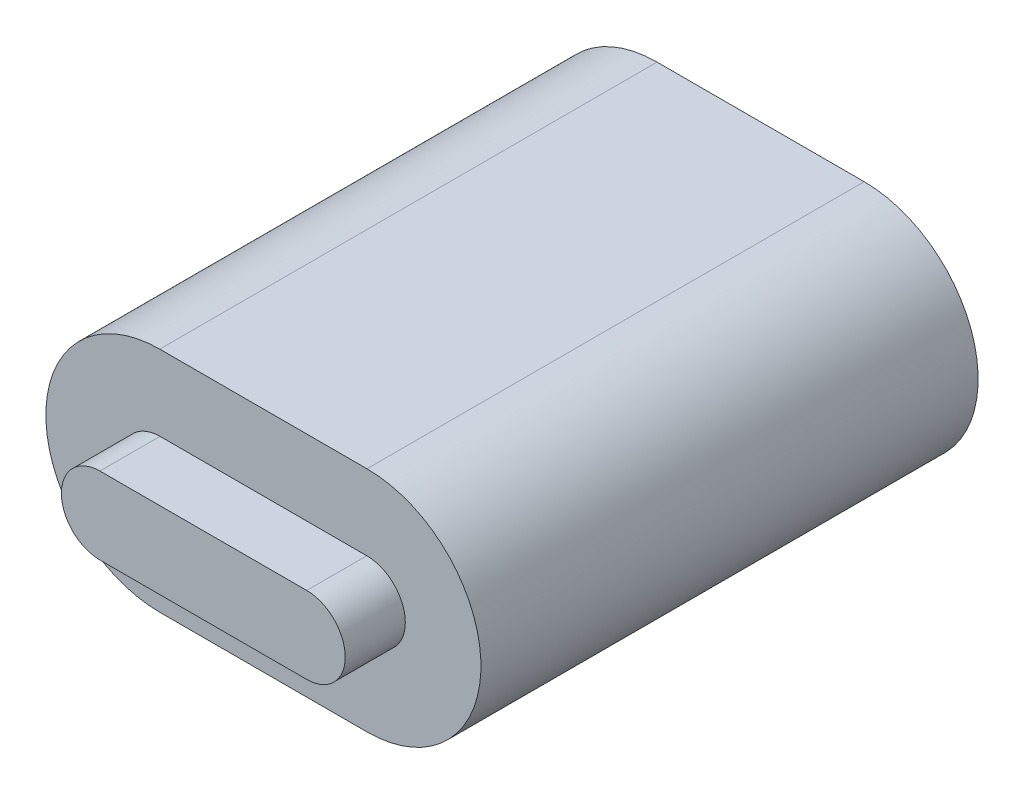
ISO-10303-21;
HEADER;
FILE_DESCRIPTION(('STEP AP214'),'2;1');
FILE_NAME('part.step','',(''),(''),'','','');
FILE_SCHEMA(('AUTOMOTIVE_DESIGN { 1 0 10303 214 1 1 1 1 }'));
ENDSEC;
DATA;
#1=APPLICATION_CONTEXT('core data for automotive mechanical design processes');
#2=APPLICATION_PROTOCOL_DEFINITION('international standard','automotive_design',2000,#1);
#3=PRODUCT_CONTEXT('',#1,'mechanical');
#4=PRODUCT('Part','Part','',(#3));
#5=PRODUCT_RELATED_PRODUCT_CATEGORY('part','',(#4));
#6=PRODUCT_DEFINITION_FORMATION('','',#4);
#7=PRODUCT_DEFINITION_CONTEXT('part definition',#1,'design');
#8=PRODUCT_DEFINITION('design','',#6,#7);
#9=PRODUCT_DEFINITION_SHAPE('','',#8);
#10=(LENGTH_UNIT() NAMED_UNIT(*) SI_UNIT(.MILLI.,.METRE.));
#11=(NAMED_UNIT(*) PLANE_ANGLE_UNIT() SI_UNIT($,.RADIAN.));
#12=(NAMED_UNIT(*) SI_UNIT($,.STERADIAN.) SOLID_ANGLE_UNIT());
#13=UNCERTAINTY_MEASURE_WITH_UNIT(LENGTH_MEASURE(1.E-05),#10,'distance_accuracy_value','');
#14=(GEOMETRIC_REPRESENTATION_CONTEXT(3) GLOBAL_UNCERTAINTY_ASSIGNED_CONTEXT((#13)) GLOBAL_UNIT_ASSIGNED_CONTEXT((#10,
#11,#12)) REPRESENTATION_CONTEXT('',''));
#15=CARTESIAN_POINT('',(0.,0.,0.));
#16=DIRECTION('',(0.,0.,1.));
#17=DIRECTION('',(1.,0.,0.));
#18=AXIS2_PLACEMENT_3D('',#15,#16,#17);
#19=CARTESIAN_POINT('',(-2.495,0.,1.45));
#20=DIRECTION('',(0.,0.,-1.));
#21=DIRECTION('',(-1.,0.,0.));
#22=AXIS2_PLACEMENT_3D('',#19,#20,#21);
#23=CYLINDRICAL_SURFACE('',#22,0.930000000000002);
#24=CARTESIAN_POINT('',(-2.495,0.,0.));
#25=DIRECTION('',(0.,0.,1.));
#26=DIRECTION('',(1.,0.,0.));
#27=AXIS2_PLACEMENT_3D('',#24,#25,#26);
#28=CIRCLE('',#27,0.930000000000002);
#29=CARTESIAN_POINT('',(-2.495,0.930000000000002,0.));
#30=VERTEX_POINT('',#29);
#31=CARTESIAN_POINT('',(-2.495,-0.930000000000002,0.));
#32=VERTEX_POINT('',#31);
#33=EDGE_CURVE('E118',#30,#32,#28,.T.);
#34=ORIENTED_EDGE('',*,*,#33,.T.);
#35=DIRECTION('',(0.,0.,-1.));
#36=VECTOR('',#35,1.);
#37=CARTESIAN_POINT('',(-2.495,-0.930000000000002,1.45));
#38=LINE('',#37,#36);
#39=CARTESIAN_POINT('',(-2.495,-0.930000000000002,1.45));
#40=VERTEX_POINT('',#39);
#41=EDGE_CURVE('E11',#40,#32,#38,.T.);
#42=ORIENTED_EDGE('',*,*,#41,.F.);
#43=CARTESIAN_POINT('',(-2.495,0.,1.45));
#44=DIRECTION('',(0.,0.,1.));
#45=DIRECTION('',(1.,0.,0.));
#46=AXIS2_PLACEMENT_3D('',#43,#44,#45);
#47=CIRCLE('',#46,0.930000000000002);
#48=CARTESIAN_POINT('',(-2.495,0.930000000000002,1.45));
#49=VERTEX_POINT('',#48);
#50=EDGE_CURVE('E127',#49,#40,#47,.T.);
#51=ORIENTED_EDGE('',*,*,#50,.F.);
#52=DIRECTION('',(0.,0.,-1.));
#53=VECTOR('',#52,1.);
#54=CARTESIAN_POINT('',(-2.495,0.930000000000002,1.45));
#55=LINE('',#54,#53);
#56=EDGE_CURVE('E134',#49,#30,#55,.T.);
#57=ORIENTED_EDGE('',*,*,#56,.T.);
#58=EDGE_LOOP('',(#34,#42,#51,#57));
#59=FACE_BOUND('',#58,.T.);
#60=ADVANCED_FACE('F33',(#59),#23,.T.);
#61=CARTESIAN_POINT('',(-2.495,-0.930000000000002,1.45));
#62=DIRECTION('',(0.,1.,0.));
#63=DIRECTION('',(0.,0.,1.));
#64=AXIS2_PLACEMENT_3D('',#61,#62,#63);
#65=PLANE('',#64);
#66=DIRECTION('',(1.,0.,0.));
#67=VECTOR('',#66,1.);
#68=CARTESIAN_POINT('',(-2.495,-0.930000000000002,0.));
#69=LINE('',#68,#67);
#70=CARTESIAN_POINT('',(2.495,-0.930000000000003,0.));
#71=VERTEX_POINT('',#70);
#72=EDGE_CURVE('E121',#32,#71,#69,.T.);
#73=ORIENTED_EDGE('',*,*,#72,.T.);
#74=DIRECTION('',(0.,0.,-1.));
#75=VECTOR('',#74,1.);
#76=CARTESIAN_POINT('',(2.495,-0.930000000000003,1.45));
#77=LINE('',#76,#75);
#78=CARTESIAN_POINT('',(2.495,-0.930000000000003,1.45));
#79=VERTEX_POINT('',#78);
#80=EDGE_CURVE('E41',#79,#71,#77,.T.);
#81=ORIENTED_EDGE('',*,*,#80,.F.);
#82=DIRECTION('',(1.,0.,0.));
#83=VECTOR('',#82,1.);
#84=CARTESIAN_POINT('',(-2.495,-0.930000000000002,1.45));
#85=LINE('',#84,#83);
#86=EDGE_CURVE('E129',#40,#79,#85,.T.);
#87=ORIENTED_EDGE('',*,*,#86,.F.);
#88=ORIENTED_EDGE('',*,*,#41,.T.);
#89=EDGE_LOOP('',(#73,#81,#87,#88));
#90=FACE_BOUND('',#89,.T.);
#91=ADVANCED_FACE('F154',(#90),#65,.F.);
#92=CARTESIAN_POINT('',(2.495,0.,1.45));
#93=DIRECTION('',(0.,0.,-1.));
#94=DIRECTION('',(-1.,0.,0.));
#95=AXIS2_PLACEMENT_3D('',#92,#93,#94);
#96=CYLINDRICAL_SURFACE('',#95,0.930000000000002);
#97=CARTESIAN_POINT('',(2.495,0.,0.));
#98=DIRECTION('',(0.,0.,1.));
#99=DIRECTION('',(1.,0.,0.));
#100=AXIS2_PLACEMENT_3D('',#97,#98,#99);
#101=CIRCLE('',#100,0.930000000000002);
#102=CARTESIAN_POINT('',(2.495,0.930000000000002,0.));
#103=VERTEX_POINT('',#102);
#104=EDGE_CURVE('E138',#71,#103,#101,.T.);
#105=ORIENTED_EDGE('',*,*,#104,.T.);
#106=DIRECTION('',(0.,0.,-1.));
#107=VECTOR('',#106,1.);
#108=CARTESIAN_POINT('',(2.495,0.930000000000002,1.45));
#109=LINE('',#108,#107);
#110=CARTESIAN_POINT('',(2.495,0.930000000000002,1.45));
#111=VERTEX_POINT('',#110);
#112=EDGE_CURVE('E145',#111,#103,#109,.T.);
#113=ORIENTED_EDGE('',*,*,#112,.F.);
#114=CARTESIAN_POINT('',(2.495,0.,1.45));
#115=DIRECTION('',(0.,0.,1.));
#116=DIRECTION('',(1.,0.,0.));
#117=AXIS2_PLACEMENT_3D('',#114,#115,#116);
#118=CIRCLE('',#117,0.930000000000002);
#119=EDGE_CURVE('E132',#79,#111,#118,.T.);
#120=ORIENTED_EDGE('',*,*,#119,.F.);
#121=ORIENTED_EDGE('',*,*,#80,.T.);
#122=EDGE_LOOP('',(#105,#113,#120,#121));
#123=FACE_BOUND('',#122,.T.);
#124=ADVANCED_FACE('F151',(#123),#96,.T.);
#125=CARTESIAN_POINT('',(-2.495,0.930000000000002,1.45));
#126=DIRECTION('',(0.,-1.,0.));
#127=DIRECTION('',(0.,0.,-1.));
#128=AXIS2_PLACEMENT_3D('',#125,#126,#127);
#129=PLANE('',#128);
#130=DIRECTION('',(-1.,0.,0.));
#131=VECTOR('',#130,1.);
#132=CARTESIAN_POINT('',(-2.495,0.930000000000002,0.));
#133=LINE('',#132,#131);
#134=EDGE_CURVE('E130',#103,#30,#133,.T.);
#135=ORIENTED_EDGE('',*,*,#134,.T.);
#136=ORIENTED_EDGE('',*,*,#56,.F.);
#137=DIRECTION('',(-1.,0.,0.));
#138=VECTOR('',#137,1.);
#139=CARTESIAN_POINT('',(-2.495,0.930000000000002,1.45));
#140=LINE('',#139,#138);
#141=EDGE_CURVE('E48',#111,#49,#140,.T.);
#142=ORIENTED_EDGE('',*,*,#141,.F.);
#143=ORIENTED_EDGE('',*,*,#112,.T.);
#144=EDGE_LOOP('',(#135,#136,#142,#143));
#145=FACE_BOUND('',#144,.T.);
#146=ADVANCED_FACE('F160',(#145),#129,.F.);
#147=CARTESIAN_POINT('',(-2.495,0.,1.45));
#148=DIRECTION('',(0.,0.,1.));
#149=DIRECTION('',(1.,0.,0.));
#150=AXIS2_PLACEMENT_3D('',#147,#148,#149);
#151=PLANE('',#150);
#152=ORIENTED_EDGE('',*,*,#50,.T.);
#153=ORIENTED_EDGE('',*,*,#86,.T.);
#154=ORIENTED_EDGE('',*,*,#119,.T.);
#155=ORIENTED_EDGE('',*,*,#141,.T.);
#156=EDGE_LOOP('',(#152,#153,#154,#155));
#157=FACE_BOUND('',#156,.T.);
#158=ADVANCED_FACE('F163',(#157),#151,.T.);
#159=CARTESIAN_POINT('',(2.5,0.,0.));
#160=DIRECTION('',(0.,0.,-1.));
#161=DIRECTION('',(-1.,0.,0.));
#162=AXIS2_PLACEMENT_3D('',#159,#160,#161);
#163=PLANE('',#162);
#164=CARTESIAN_POINT('',(2.5,0.,0.));
#165=DIRECTION('',(0.,0.,-1.));
#166=DIRECTION('',(-1.,0.,0.));
#167=AXIS2_PLACEMENT_3D('',#164,#165,#166);
#168=CIRCLE('',#167,2.75);
#169=CARTESIAN_POINT('',(2.5,2.75,0.));
#170=VERTEX_POINT('',#169);
#171=CARTESIAN_POINT('',(2.5,-2.75,0.));
#172=VERTEX_POINT('',#171);
#173=EDGE_CURVE('E117',#170,#172,#168,.T.);
#174=ORIENTED_EDGE('',*,*,#173,.F.);
#175=DIRECTION('',(1.,0.,0.));
#176=VECTOR('',#175,1.);
#177=CARTESIAN_POINT('',(2.5,2.75,0.));
#178=LINE('',#177,#176);
#179=CARTESIAN_POINT('',(-2.5,2.75,0.));
#180=VERTEX_POINT('',#179);
#181=EDGE_CURVE('E113',#180,#170,#178,.T.);
#182=ORIENTED_EDGE('',*,*,#181,.F.);
#183=CARTESIAN_POINT('',(-2.5,0.,0.));
#184=DIRECTION('',(0.,0.,-1.));
#185=DIRECTION('',(-1.,0.,0.));
#186=AXIS2_PLACEMENT_3D('',#183,#184,#185);
#187=CIRCLE('',#186,2.75);
#188=CARTESIAN_POINT('',(-2.5,-2.75,0.));
#189=VERTEX_POINT('',#188);
#190=EDGE_CURVE('E247',#189,#180,#187,.T.);
#191=ORIENTED_EDGE('',*,*,#190,.F.);
#192=DIRECTION('',(-1.,0.,0.));
#193=VECTOR('',#192,1.);
#194=CARTESIAN_POINT('',(2.5,-2.75,0.));
#195=LINE('',#194,#193);
#196=EDGE_CURVE('E250',#172,#189,#195,.T.);
#197=ORIENTED_EDGE('',*,*,#196,.F.);
#198=EDGE_LOOP('',(#174,#182,#191,#197));
#199=FACE_BOUND('',#198,.T.);
#200=ORIENTED_EDGE('',*,*,#72,.F.);
#201=ORIENTED_EDGE('',*,*,#33,.F.);
#202=ORIENTED_EDGE('',*,*,#134,.F.);
#203=ORIENTED_EDGE('',*,*,#104,.F.);
#204=EDGE_LOOP('',(#200,#201,#202,#203));
#205=FACE_BOUND('',#204,.T.);
#206=ADVANCED_FACE('F158',(#199,#205),#163,.F.);
#207=CARTESIAN_POINT('',(2.5,0.,-12.));
#208=DIRECTION('',(0.,0.,1.));
#209=DIRECTION('',(1.,0.,0.));
#210=AXIS2_PLACEMENT_3D('',#207,#208,#209);
#211=CYLINDRICAL_SURFACE('',#210,2.75);
#212=ORIENTED_EDGE('',*,*,#173,.T.);
#213=DIRECTION('',(0.,0.,1.));
#214=VECTOR('',#213,1.);
#215=CARTESIAN_POINT('',(2.5,-2.75,-12.));
#216=LINE('',#215,#214);
#217=CARTESIAN_POINT('',(2.5,-2.75,-12.));
#218=VERTEX_POINT('',#217);
#219=EDGE_CURVE('E97',#218,#172,#216,.T.);
#220=ORIENTED_EDGE('',*,*,#219,.F.);
#221=CARTESIAN_POINT('',(2.5,0.,-12.));
#222=DIRECTION('',(0.,0.,-1.));
#223=DIRECTION('',(-1.,0.,0.));
#224=AXIS2_PLACEMENT_3D('',#221,#222,#223);
#225=CIRCLE('',#224,2.75);
#226=CARTESIAN_POINT('',(2.5,2.75,-12.));
#227=VERTEX_POINT('',#226);
#228=EDGE_CURVE('E104',#227,#218,#225,.T.);
#229=ORIENTED_EDGE('',*,*,#228,.F.);
#230=DIRECTION('',(0.,0.,1.));
#231=VECTOR('',#230,1.);
#232=CARTESIAN_POINT('',(2.5,2.75,-12.));
#233=LINE('',#232,#231);
#234=EDGE_CURVE('E244',#227,#170,#233,.T.);
#235=ORIENTED_EDGE('',*,*,#234,.T.);
#236=EDGE_LOOP('',(#212,#220,#229,#235));
#237=FACE_BOUND('',#236,.T.);
#238=ADVANCED_FACE('F115',(#237),#211,.T.);
#239=CARTESIAN_POINT('',(2.5,-2.75,-12.));
#240=DIRECTION('',(0.,1.,0.));
#241=DIRECTION('',(0.,0.,1.));
#242=AXIS2_PLACEMENT_3D('',#239,#240,#241);
#243=PLANE('',#242);
#244=ORIENTED_EDGE('',*,*,#196,.T.);
#245=DIRECTION('',(0.,0.,1.));
#246=VECTOR('',#245,1.);
#247=CARTESIAN_POINT('',(-2.5,-2.75,-12.));
#248=LINE('',#247,#246);
#249=CARTESIAN_POINT('',(-2.5,-2.75,-12.));
#250=VERTEX_POINT('',#249);
#251=EDGE_CURVE('E100',#250,#189,#248,.T.);
#252=ORIENTED_EDGE('',*,*,#251,.F.);
#253=DIRECTION('',(-1.,0.,0.));
#254=VECTOR('',#253,1.);
#255=CARTESIAN_POINT('',(2.5,-2.75,-12.));
#256=LINE('',#255,#254);
#257=EDGE_CURVE('E93',#218,#250,#256,.T.);
#258=ORIENTED_EDGE('',*,*,#257,.F.);
#259=ORIENTED_EDGE('',*,*,#219,.T.);
#260=EDGE_LOOP('',(#244,#252,#258,#259));
#261=FACE_BOUND('',#260,.T.);
#262=ADVANCED_FACE('F95',(#261),#243,.F.);
#263=CARTESIAN_POINT('',(-2.5,0.,-12.));
#264=DIRECTION('',(0.,0.,1.));
#265=DIRECTION('',(1.,0.,0.));
#266=AXIS2_PLACEMENT_3D('',#263,#264,#265);
#267=CYLINDRICAL_SURFACE('',#266,2.75);
#268=ORIENTED_EDGE('',*,*,#190,.T.);
#269=DIRECTION('',(0.,0.,1.));
#270=VECTOR('',#269,1.);
#271=CARTESIAN_POINT('',(-2.5,2.75,-12.));
#272=LINE('',#271,#270);
#273=CARTESIAN_POINT('',(-2.5,2.75,-12.));
#274=VERTEX_POINT('',#273);
#275=EDGE_CURVE('E123',#274,#180,#272,.T.);
#276=ORIENTED_EDGE('',*,*,#275,.F.);
#277=CARTESIAN_POINT('',(-2.5,0.,-12.));
#278=DIRECTION('',(0.,0.,-1.));
#279=DIRECTION('',(-1.,0.,0.));
#280=AXIS2_PLACEMENT_3D('',#277,#278,#279);
#281=CIRCLE('',#280,2.75);
#282=EDGE_CURVE('E103',#250,#274,#281,.T.);
#283=ORIENTED_EDGE('',*,*,#282,.F.);
#284=ORIENTED_EDGE('',*,*,#251,.T.);
#285=EDGE_LOOP('',(#268,#276,#283,#284));
#286=FACE_BOUND('',#285,.T.);
#287=ADVANCED_FACE('F211',(#286),#267,.T.);
#288=CARTESIAN_POINT('',(2.5,2.75,-12.));
#289=DIRECTION('',(0.,-1.,0.));
#290=DIRECTION('',(0.,0.,-1.));
#291=AXIS2_PLACEMENT_3D('',#288,#289,#290);
#292=PLANE('',#291);
#293=ORIENTED_EDGE('',*,*,#181,.T.);
#294=ORIENTED_EDGE('',*,*,#234,.F.);
#295=DIRECTION('',(1.,0.,0.));
#296=VECTOR('',#295,1.);
#297=CARTESIAN_POINT('',(2.5,2.75,-12.));
#298=LINE('',#297,#296);
#299=EDGE_CURVE('E109',#274,#227,#298,.T.);
#300=ORIENTED_EDGE('',*,*,#299,.F.);
#301=ORIENTED_EDGE('',*,*,#275,.T.);
#302=EDGE_LOOP('',(#293,#294,#300,#301));
#303=FACE_BOUND('',#302,.T.);
#304=ADVANCED_FACE('F220',(#303),#292,.F.);
#305=CARTESIAN_POINT('',(2.5,0.,-12.));
#306=DIRECTION('',(0.,0.,-1.));
#307=DIRECTION('',(-1.,0.,0.));
#308=AXIS2_PLACEMENT_3D('',#305,#306,#307);
#309=PLANE('',#308);
#310=ORIENTED_EDGE('',*,*,#228,.T.);
#311=ORIENTED_EDGE('',*,*,#257,.T.);
#312=ORIENTED_EDGE('',*,*,#282,.T.);
#313=ORIENTED_EDGE('',*,*,#299,.T.);
#314=EDGE_LOOP('',(#310,#311,#312,#313));
#315=FACE_BOUND('',#314,.T.);
#316=ADVANCED_FACE('F107',(#315),#309,.T.);
#317=CLOSED_SHELL('',(#60,#91,#124,#146,#158,#206,#238,#262,#287,#304,#316));
#318=MANIFOLD_SOLID_BREP('B2',#317);
#319=ADVANCED_BREP_SHAPE_REPRESENTATION('',(#18,#318),#14);
#320=SHAPE_DEFINITION_REPRESENTATION(#9,#319);
ENDSEC;
END-ISO-10303-21;
